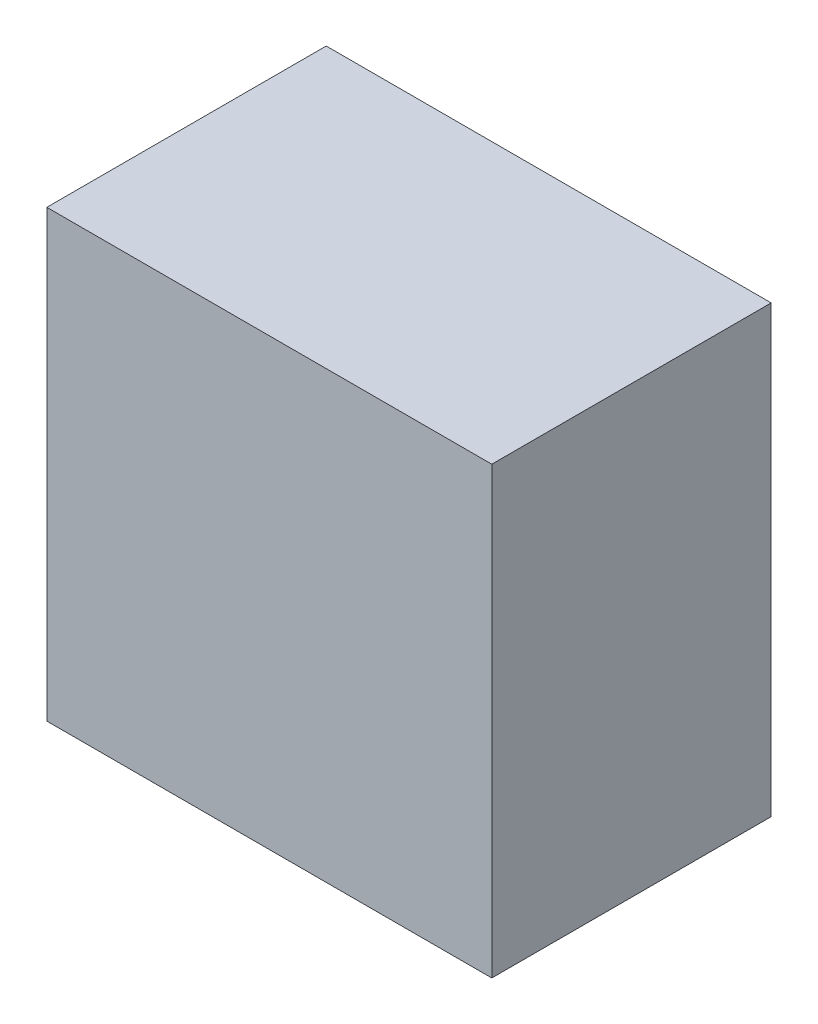
ISO-10303-21;
HEADER;
FILE_DESCRIPTION(('STEP AP214'),'2;1');
FILE_NAME('part.step','',(''),(''),'','','');
FILE_SCHEMA(('AUTOMOTIVE_DESIGN { 1 0 10303 214 1 1 1 1 }'));
ENDSEC;
DATA;
#1=APPLICATION_CONTEXT('core data for automotive mechanical design processes');
#2=APPLICATION_PROTOCOL_DEFINITION('international standard','automotive_design',2000,#1);
#3=PRODUCT_CONTEXT('',#1,'mechanical');
#4=PRODUCT('Part','Part','',(#3));
#5=PRODUCT_RELATED_PRODUCT_CATEGORY('part','',(#4));
#6=PRODUCT_DEFINITION_FORMATION('','',#4);
#7=PRODUCT_DEFINITION_CONTEXT('part definition',#1,'design');
#8=PRODUCT_DEFINITION('design','',#6,#7);
#9=PRODUCT_DEFINITION_SHAPE('','',#8);
#10=(LENGTH_UNIT() NAMED_UNIT(*) SI_UNIT(.MILLI.,.METRE.));
#11=(NAMED_UNIT(*) PLANE_ANGLE_UNIT() SI_UNIT($,.RADIAN.));
#12=(NAMED_UNIT(*) SI_UNIT($,.STERADIAN.) SOLID_ANGLE_UNIT());
#13=UNCERTAINTY_MEASURE_WITH_UNIT(LENGTH_MEASURE(1.E-05),#10,'distance_accuracy_value','');
#14=(GEOMETRIC_REPRESENTATION_CONTEXT(3) GLOBAL_UNCERTAINTY_ASSIGNED_CONTEXT((#13)) GLOBAL_UNIT_ASSIGNED_CONTEXT((#10,
#11,#12)) REPRESENTATION_CONTEXT('',''));
#15=CARTESIAN_POINT('',(0.,0.,0.));
#16=DIRECTION('',(0.,0.,1.));
#17=DIRECTION('',(1.,0.,0.));
#18=AXIS2_PLACEMENT_3D('',#15,#16,#17);
#19=CARTESIAN_POINT('',(21.5,-21.5,27.));
#20=DIRECTION('',(-1.,0.,0.));
#21=DIRECTION('',(0.,0.,1.));
#22=AXIS2_PLACEMENT_3D('',#19,#20,#21);
#23=PLANE('',#22);
#24=DIRECTION('',(0.,1.,0.));
#25=VECTOR('',#24,1.);
#26=CARTESIAN_POINT('',(21.5,-21.5,0.));
#27=LINE('',#26,#25);
#28=CARTESIAN_POINT('',(21.5,-21.5,0.));
#29=VERTEX_POINT('',#28);
#30=CARTESIAN_POINT('',(21.5,21.5,0.));
#31=VERTEX_POINT('',#30);
#32=EDGE_CURVE('E111',#29,#31,#27,.T.);
#33=ORIENTED_EDGE('',*,*,#32,.T.);
#34=DIRECTION('',(0.,0.,-1.));
#35=VECTOR('',#34,1.);
#36=CARTESIAN_POINT('',(21.5,21.5,27.));
#37=LINE('',#36,#35);
#38=CARTESIAN_POINT('',(21.5,21.5,27.));
#39=VERTEX_POINT('',#38);
#40=EDGE_CURVE('E11',#39,#31,#37,.T.);
#41=ORIENTED_EDGE('',*,*,#40,.F.);
#42=DIRECTION('',(0.,1.,0.));
#43=VECTOR('',#42,1.);
#44=CARTESIAN_POINT('',(21.5,-21.5,27.));
#45=LINE('',#44,#43);
#46=CARTESIAN_POINT('',(21.5,-21.5,27.));
#47=VERTEX_POINT('',#46);
#48=EDGE_CURVE('E95',#47,#39,#45,.T.);
#49=ORIENTED_EDGE('',*,*,#48,.F.);
#50=DIRECTION('',(0.,0.,-1.));
#51=VECTOR('',#50,1.);
#52=CARTESIAN_POINT('',(21.5,-21.5,27.));
#53=LINE('',#52,#51);
#54=EDGE_CURVE('E107',#47,#29,#53,.T.);
#55=ORIENTED_EDGE('',*,*,#54,.T.);
#56=EDGE_LOOP('',(#33,#41,#49,#55));
#57=FACE_BOUND('',#56,.T.);
#58=ADVANCED_FACE('F43',(#57),#23,.F.);
#59=CARTESIAN_POINT('',(-21.5,21.5,27.));
#60=DIRECTION('',(0.,-1.,0.));
#61=DIRECTION('',(0.,0.,-1.));
#62=AXIS2_PLACEMENT_3D('',#59,#60,#61);
#63=PLANE('',#62);
#64=DIRECTION('',(-1.,0.,0.));
#65=VECTOR('',#64,1.);
#66=CARTESIAN_POINT('',(-21.5,21.5,0.));
#67=LINE('',#66,#65);
#68=CARTESIAN_POINT('',(-21.5,21.5,0.));
#69=VERTEX_POINT('',#68);
#70=EDGE_CURVE('E100',#31,#69,#67,.T.);
#71=ORIENTED_EDGE('',*,*,#70,.T.);
#72=DIRECTION('',(0.,0.,-1.));
#73=VECTOR('',#72,1.);
#74=CARTESIAN_POINT('',(-21.5,21.5,27.));
#75=LINE('',#74,#73);
#76=CARTESIAN_POINT('',(-21.5,21.5,27.));
#77=VERTEX_POINT('',#76);
#78=EDGE_CURVE('E52',#77,#69,#75,.T.);
#79=ORIENTED_EDGE('',*,*,#78,.F.);
#80=DIRECTION('',(-1.,0.,0.));
#81=VECTOR('',#80,1.);
#82=CARTESIAN_POINT('',(-21.5,21.5,27.));
#83=LINE('',#82,#81);
#84=EDGE_CURVE('E90',#39,#77,#83,.T.);
#85=ORIENTED_EDGE('',*,*,#84,.F.);
#86=ORIENTED_EDGE('',*,*,#40,.T.);
#87=EDGE_LOOP('',(#71,#79,#85,#86));
#88=FACE_BOUND('',#87,.T.);
#89=ADVANCED_FACE('F99',(#88),#63,.F.);
#90=CARTESIAN_POINT('',(-21.5,-21.5,27.));
#91=DIRECTION('',(1.,0.,0.));
#92=DIRECTION('',(0.,0.,-1.));
#93=AXIS2_PLACEMENT_3D('',#90,#91,#92);
#94=PLANE('',#93);
#95=DIRECTION('',(0.,-1.,0.));
#96=VECTOR('',#95,1.);
#97=CARTESIAN_POINT('',(-21.5,-21.5,0.));
#98=LINE('',#97,#96);
#99=CARTESIAN_POINT('',(-21.5,-21.5,0.));
#100=VERTEX_POINT('',#99);
#101=EDGE_CURVE('E77',#69,#100,#98,.T.);
#102=ORIENTED_EDGE('',*,*,#101,.T.);
#103=DIRECTION('',(0.,0.,-1.));
#104=VECTOR('',#103,1.);
#105=CARTESIAN_POINT('',(-21.5,-21.5,27.));
#106=LINE('',#105,#104);
#107=CARTESIAN_POINT('',(-21.5,-21.5,27.));
#108=VERTEX_POINT('',#107);
#109=EDGE_CURVE('E102',#108,#100,#106,.T.);
#110=ORIENTED_EDGE('',*,*,#109,.F.);
#111=DIRECTION('',(0.,-1.,0.));
#112=VECTOR('',#111,1.);
#113=CARTESIAN_POINT('',(-21.5,-21.5,27.));
#114=LINE('',#113,#112);
#115=EDGE_CURVE('E93',#77,#108,#114,.T.);
#116=ORIENTED_EDGE('',*,*,#115,.F.);
#117=ORIENTED_EDGE('',*,*,#78,.T.);
#118=EDGE_LOOP('',(#102,#110,#116,#117));
#119=FACE_BOUND('',#118,.T.);
#120=ADVANCED_FACE('F103',(#119),#94,.F.);
#121=CARTESIAN_POINT('',(-21.5,-21.5,27.));
#122=DIRECTION('',(0.,1.,0.));
#123=DIRECTION('',(0.,0.,1.));
#124=AXIS2_PLACEMENT_3D('',#121,#122,#123);
#125=PLANE('',#124);
#126=DIRECTION('',(1.,0.,0.));
#127=VECTOR('',#126,1.);
#128=CARTESIAN_POINT('',(-21.5,-21.5,0.));
#129=LINE('',#128,#127);
#130=EDGE_CURVE('E83',#100,#29,#129,.T.);
#131=ORIENTED_EDGE('',*,*,#130,.T.);
#132=ORIENTED_EDGE('',*,*,#54,.F.);
#133=DIRECTION('',(1.,0.,0.));
#134=VECTOR('',#133,1.);
#135=CARTESIAN_POINT('',(-21.5,-21.5,27.));
#136=LINE('',#135,#134);
#137=EDGE_CURVE('E60',#108,#47,#136,.T.);
#138=ORIENTED_EDGE('',*,*,#137,.F.);
#139=ORIENTED_EDGE('',*,*,#109,.T.);
#140=EDGE_LOOP('',(#131,#132,#138,#139));
#141=FACE_BOUND('',#140,.T.);
#142=ADVANCED_FACE('F124',(#141),#125,.F.);
#143=CARTESIAN_POINT('',(0.,0.,27.));
#144=DIRECTION('',(0.,0.,-1.));
#145=DIRECTION('',(-1.,0.,0.));
#146=AXIS2_PLACEMENT_3D('',#143,#144,#145);
#147=PLANE('',#146);
#148=ORIENTED_EDGE('',*,*,#48,.T.);
#149=ORIENTED_EDGE('',*,*,#84,.T.);
#150=ORIENTED_EDGE('',*,*,#115,.T.);
#151=ORIENTED_EDGE('',*,*,#137,.T.);
#152=EDGE_LOOP('',(#148,#149,#150,#151));
#153=FACE_BOUND('',#152,.T.);
#154=ADVANCED_FACE('F91',(#153),#147,.F.);
#155=CARTESIAN_POINT('',(0.,0.,0.));
#156=DIRECTION('',(0.,0.,-1.));
#157=DIRECTION('',(-1.,0.,0.));
#158=AXIS2_PLACEMENT_3D('',#155,#156,#157);
#159=PLANE('',#158);
#160=ORIENTED_EDGE('',*,*,#32,.F.);
#161=ORIENTED_EDGE('',*,*,#130,.F.);
#162=ORIENTED_EDGE('',*,*,#101,.F.);
#163=ORIENTED_EDGE('',*,*,#70,.F.);
#164=EDGE_LOOP('',(#160,#161,#162,#163));
#165=FACE_BOUND('',#164,.T.);
#166=ADVANCED_FACE('F127',(#165),#159,.T.);
#167=CLOSED_SHELL('',(#58,#89,#120,#142,#154,#166));
#168=MANIFOLD_SOLID_BREP('B2',#167);
#169=ADVANCED_BREP_SHAPE_REPRESENTATION('',(#18,#168),#14);
#170=SHAPE_DEFINITION_REPRESENTATION(#9,#169);
ENDSEC;
END-ISO-10303-21;
